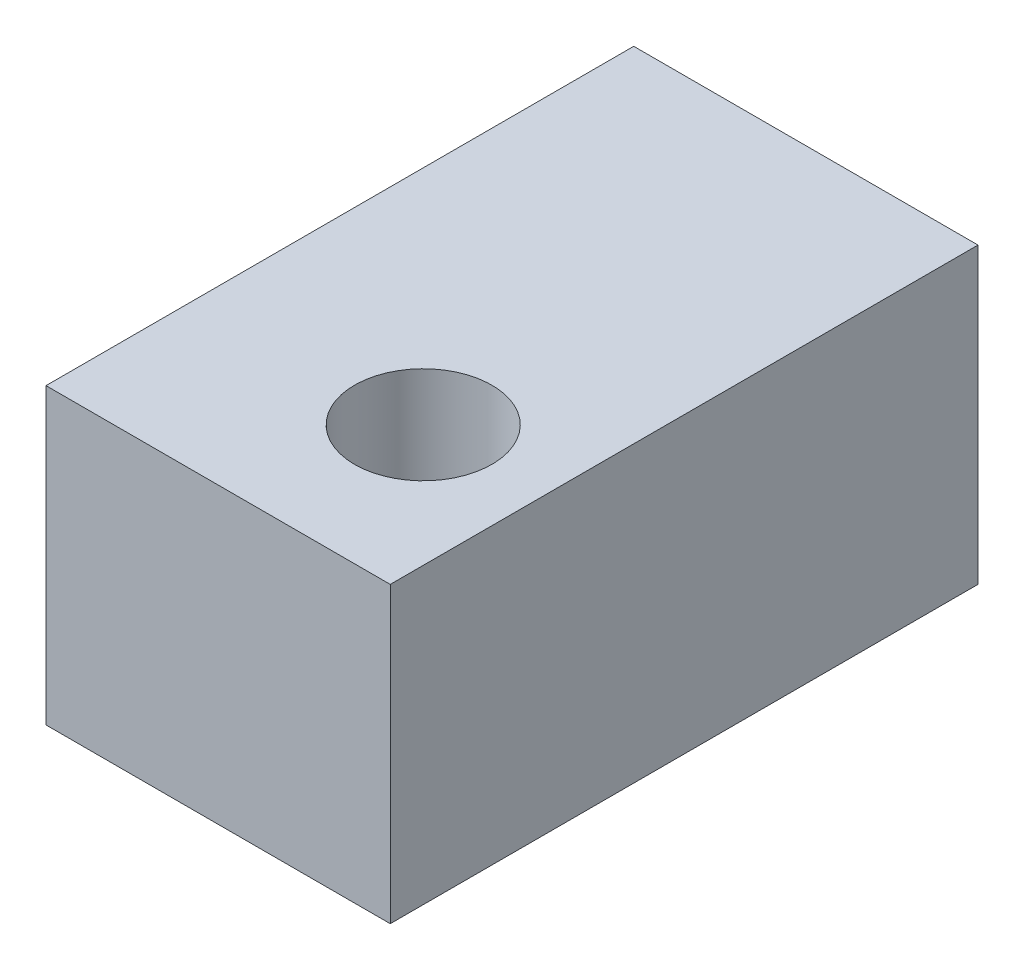
ISO-10303-21;
HEADER;
FILE_DESCRIPTION(('STEP AP214'),'2;1');
FILE_NAME('part.step','',(''),(''),'','','');
FILE_SCHEMA(('AUTOMOTIVE_DESIGN { 1 0 10303 214 1 1 1 1 }'));
ENDSEC;
DATA;
#1=APPLICATION_CONTEXT('core data for automotive mechanical design processes');
#2=APPLICATION_PROTOCOL_DEFINITION('international standard','automotive_design',2000,#1);
#3=PRODUCT_CONTEXT('',#1,'mechanical');
#4=PRODUCT('Part','Part','',(#3));
#5=PRODUCT_RELATED_PRODUCT_CATEGORY('part','',(#4));
#6=PRODUCT_DEFINITION_FORMATION('','',#4);
#7=PRODUCT_DEFINITION_CONTEXT('part definition',#1,'design');
#8=PRODUCT_DEFINITION('design','',#6,#7);
#9=PRODUCT_DEFINITION_SHAPE('','',#8);
#10=(LENGTH_UNIT() NAMED_UNIT(*) SI_UNIT(.MILLI.,.METRE.));
#11=(NAMED_UNIT(*) PLANE_ANGLE_UNIT() SI_UNIT($,.RADIAN.));
#12=(NAMED_UNIT(*) SI_UNIT($,.STERADIAN.) SOLID_ANGLE_UNIT());
#13=UNCERTAINTY_MEASURE_WITH_UNIT(LENGTH_MEASURE(1.E-05),#10,'distance_accuracy_value','');
#14=(GEOMETRIC_REPRESENTATION_CONTEXT(3) GLOBAL_UNCERTAINTY_ASSIGNED_CONTEXT((#13)) GLOBAL_UNIT_ASSIGNED_CONTEXT((#10,
#11,#12)) REPRESENTATION_CONTEXT('',''));
#15=CARTESIAN_POINT('',(0.,0.,0.));
#16=DIRECTION('',(0.,0.,1.));
#17=DIRECTION('',(1.,0.,0.));
#18=AXIS2_PLACEMENT_3D('',#15,#16,#17);
#19=CARTESIAN_POINT('',(0.,0.,350.));
#20=DIRECTION('',(1.,0.,0.));
#21=DIRECTION('',(0.,0.,-1.));
#22=AXIS2_PLACEMENT_3D('',#19,#20,#21);
#23=PLANE('',#22);
#24=DIRECTION('',(0.,-1.,0.));
#25=VECTOR('',#24,1.);
#26=CARTESIAN_POINT('',(0.,0.,0.));
#27=LINE('',#26,#25);
#28=CARTESIAN_POINT('',(0.,175.,0.));
#29=VERTEX_POINT('',#28);
#30=CARTESIAN_POINT('',(0.,0.,0.));
#31=VERTEX_POINT('',#30);
#32=EDGE_CURVE('E96',#29,#31,#27,.T.);
#33=ORIENTED_EDGE('',*,*,#32,.T.);
#34=DIRECTION('',(0.,0.,-1.));
#35=VECTOR('',#34,1.);
#36=CARTESIAN_POINT('',(0.,0.,350.));
#37=LINE('',#36,#35);
#38=CARTESIAN_POINT('',(0.,0.,350.));
#39=VERTEX_POINT('',#38);
#40=EDGE_CURVE('E11',#39,#31,#37,.T.);
#41=ORIENTED_EDGE('',*,*,#40,.F.);
#42=DIRECTION('',(0.,-1.,0.));
#43=VECTOR('',#42,1.);
#44=CARTESIAN_POINT('',(0.,0.,350.));
#45=LINE('',#44,#43);
#46=CARTESIAN_POINT('',(0.,175.,350.));
#47=VERTEX_POINT('',#46);
#48=EDGE_CURVE('E84',#47,#39,#45,.T.);
#49=ORIENTED_EDGE('',*,*,#48,.F.);
#50=DIRECTION('',(0.,0.,-1.));
#51=VECTOR('',#50,1.);
#52=CARTESIAN_POINT('',(0.,175.,350.));
#53=LINE('',#52,#51);
#54=EDGE_CURVE('E92',#47,#29,#53,.T.);
#55=ORIENTED_EDGE('',*,*,#54,.T.);
#56=EDGE_LOOP('',(#33,#41,#49,#55));
#57=FACE_BOUND('',#56,.T.);
#58=ADVANCED_FACE('F33',(#57),#23,.F.);
#59=CARTESIAN_POINT('',(0.,0.,350.));
#60=DIRECTION('',(0.,1.,0.));
#61=DIRECTION('',(0.,0.,1.));
#62=AXIS2_PLACEMENT_3D('',#59,#60,#61);
#63=PLANE('',#62);
#64=DIRECTION('',(1.,0.,0.));
#65=VECTOR('',#64,1.);
#66=CARTESIAN_POINT('',(0.,0.,0.));
#67=LINE('',#66,#65);
#68=CARTESIAN_POINT('',(205.,0.,0.));
#69=VERTEX_POINT('',#68);
#70=EDGE_CURVE('E88',#31,#69,#67,.T.);
#71=ORIENTED_EDGE('',*,*,#70,.T.);
#72=DIRECTION('',(0.,0.,-1.));
#73=VECTOR('',#72,1.);
#74=CARTESIAN_POINT('',(205.,0.,350.));
#75=LINE('',#74,#73);
#76=CARTESIAN_POINT('',(205.,0.,350.));
#77=VERTEX_POINT('',#76);
#78=EDGE_CURVE('E41',#77,#69,#75,.T.);
#79=ORIENTED_EDGE('',*,*,#78,.F.);
#80=DIRECTION('',(1.,0.,0.));
#81=VECTOR('',#80,1.);
#82=CARTESIAN_POINT('',(0.,0.,350.));
#83=LINE('',#82,#81);
#84=EDGE_CURVE('E79',#39,#77,#83,.T.);
#85=ORIENTED_EDGE('',*,*,#84,.F.);
#86=ORIENTED_EDGE('',*,*,#40,.T.);
#87=EDGE_LOOP('',(#71,#79,#85,#86));
#88=FACE_BOUND('',#87,.T.);
#89=ADVANCED_FACE('F87',(#88),#63,.F.);
#90=CARTESIAN_POINT('',(205.,0.,350.));
#91=DIRECTION('',(-1.,0.,0.));
#92=DIRECTION('',(0.,0.,1.));
#93=AXIS2_PLACEMENT_3D('',#90,#91,#92);
#94=PLANE('',#93);
#95=DIRECTION('',(0.,1.,0.));
#96=VECTOR('',#95,1.);
#97=CARTESIAN_POINT('',(205.,0.,0.));
#98=LINE('',#97,#96);
#99=CARTESIAN_POINT('',(205.,175.,0.));
#100=VERTEX_POINT('',#99);
#101=EDGE_CURVE('E66',#69,#100,#98,.T.);
#102=ORIENTED_EDGE('',*,*,#101,.T.);
#103=DIRECTION('',(0.,0.,-1.));
#104=VECTOR('',#103,1.);
#105=CARTESIAN_POINT('',(205.,175.,350.));
#106=LINE('',#105,#104);
#107=CARTESIAN_POINT('',(205.,175.,350.));
#108=VERTEX_POINT('',#107);
#109=EDGE_CURVE('E89',#108,#100,#106,.T.);
#110=ORIENTED_EDGE('',*,*,#109,.F.);
#111=DIRECTION('',(0.,1.,0.));
#112=VECTOR('',#111,1.);
#113=CARTESIAN_POINT('',(205.,0.,350.));
#114=LINE('',#113,#112);
#115=EDGE_CURVE('E82',#77,#108,#114,.T.);
#116=ORIENTED_EDGE('',*,*,#115,.F.);
#117=ORIENTED_EDGE('',*,*,#78,.T.);
#118=EDGE_LOOP('',(#102,#110,#116,#117));
#119=FACE_BOUND('',#118,.T.);
#120=ADVANCED_FACE('F90',(#119),#94,.F.);
#121=CARTESIAN_POINT('',(0.,175.,350.));
#122=DIRECTION('',(0.,-1.,0.));
#123=DIRECTION('',(0.,0.,-1.));
#124=AXIS2_PLACEMENT_3D('',#121,#122,#123);
#125=PLANE('',#124);
#126=CARTESIAN_POINT('',(132.50302804687,175.,257.884998031273));
#127=DIRECTION('',(0.,1.,0.));
#128=DIRECTION('',(0.,0.,1.));
#129=AXIS2_PLACEMENT_3D('',#126,#127,#128);
#130=CIRCLE('',#129,40.885164141941);
#131=CARTESIAN_POINT('',(132.50302804687,175.,298.770162173214));
#132=VERTEX_POINT('',#131);
#133=EDGE_CURVE('E110',#132,#132,#130,.T.);
#134=ORIENTED_EDGE('',*,*,#133,.F.);
#135=EDGE_LOOP('',(#134));
#136=FACE_BOUND('',#135,.T.);
#137=DIRECTION('',(-1.,0.,0.));
#138=VECTOR('',#137,1.);
#139=CARTESIAN_POINT('',(0.,175.,0.));
#140=LINE('',#139,#138);
#141=EDGE_CURVE('E72',#100,#29,#140,.T.);
#142=ORIENTED_EDGE('',*,*,#141,.T.);
#143=ORIENTED_EDGE('',*,*,#54,.F.);
#144=DIRECTION('',(-1.,0.,0.));
#145=VECTOR('',#144,1.);
#146=CARTESIAN_POINT('',(0.,175.,350.));
#147=LINE('',#146,#145);
#148=EDGE_CURVE('E49',#108,#47,#147,.T.);
#149=ORIENTED_EDGE('',*,*,#148,.F.);
#150=ORIENTED_EDGE('',*,*,#109,.T.);
#151=EDGE_LOOP('',(#142,#143,#149,#150));
#152=FACE_BOUND('',#151,.T.);
#153=ADVANCED_FACE('F104',(#136,#152),#125,.F.);
#154=CARTESIAN_POINT('',(0.,0.,350.));
#155=DIRECTION('',(0.,0.,-1.));
#156=DIRECTION('',(-1.,0.,0.));
#157=AXIS2_PLACEMENT_3D('',#154,#155,#156);
#158=PLANE('',#157);
#159=ORIENTED_EDGE('',*,*,#48,.T.);
#160=ORIENTED_EDGE('',*,*,#84,.T.);
#161=ORIENTED_EDGE('',*,*,#115,.T.);
#162=ORIENTED_EDGE('',*,*,#148,.T.);
#163=EDGE_LOOP('',(#159,#160,#161,#162));
#164=FACE_BOUND('',#163,.T.);
#165=ADVANCED_FACE('F80',(#164),#158,.F.);
#166=CARTESIAN_POINT('',(0.,0.,0.));
#167=DIRECTION('',(0.,0.,-1.));
#168=DIRECTION('',(-1.,0.,0.));
#169=AXIS2_PLACEMENT_3D('',#166,#167,#168);
#170=PLANE('',#169);
#171=ORIENTED_EDGE('',*,*,#32,.F.);
#172=ORIENTED_EDGE('',*,*,#141,.F.);
#173=ORIENTED_EDGE('',*,*,#101,.F.);
#174=ORIENTED_EDGE('',*,*,#70,.F.);
#175=EDGE_LOOP('',(#171,#172,#173,#174));
#176=FACE_BOUND('',#175,.T.);
#177=ADVANCED_FACE('F107',(#176),#170,.T.);
#178=CARTESIAN_POINT('',(132.50302804687,75.,257.884998031273));
#179=DIRECTION('',(0.,1.,0.));
#180=DIRECTION('',(0.,0.,1.));
#181=AXIS2_PLACEMENT_3D('',#178,#179,#180);
#182=CYLINDRICAL_SURFACE('',#181,40.885164141941);
#183=CARTESIAN_POINT('',(132.50302804687,75.,257.884998031273));
#184=DIRECTION('',(0.,1.,0.));
#185=DIRECTION('',(0.,0.,1.));
#186=AXIS2_PLACEMENT_3D('',#183,#184,#185);
#187=CIRCLE('',#186,40.885164141941);
#188=CARTESIAN_POINT('',(132.50302804687,75.,298.770162173214));
#189=VERTEX_POINT('',#188);
#190=EDGE_CURVE('E99',#189,#189,#187,.T.);
#191=ORIENTED_EDGE('',*,*,#190,.F.);
#192=EDGE_LOOP('',(#191));
#193=FACE_BOUND('',#192,.T.);
#194=ORIENTED_EDGE('',*,*,#133,.T.);
#195=EDGE_LOOP('',(#194));
#196=FACE_BOUND('',#195,.T.);
#197=ADVANCED_FACE('F118',(#193,#196),#182,.F.);
#198=CARTESIAN_POINT('',(132.50302804687,75.,257.884998031273));
#199=DIRECTION('',(0.,1.,0.));
#200=DIRECTION('',(0.,0.,1.));
#201=AXIS2_PLACEMENT_3D('',#198,#199,#200);
#202=PLANE('',#201);
#203=ORIENTED_EDGE('',*,*,#190,.T.);
#204=EDGE_LOOP('',(#203));
#205=FACE_BOUND('',#204,.T.);
#206=ADVANCED_FACE('F116',(#205),#202,.T.);
#207=CLOSED_SHELL('',(#58,#89,#120,#153,#165,#177,#197,#206));
#208=MANIFOLD_SOLID_BREP('B2',#207);
#209=ADVANCED_BREP_SHAPE_REPRESENTATION('',(#18,#208),#14);
#210=SHAPE_DEFINITION_REPRESENTATION(#9,#209);
ENDSEC;
END-ISO-10303-21;
